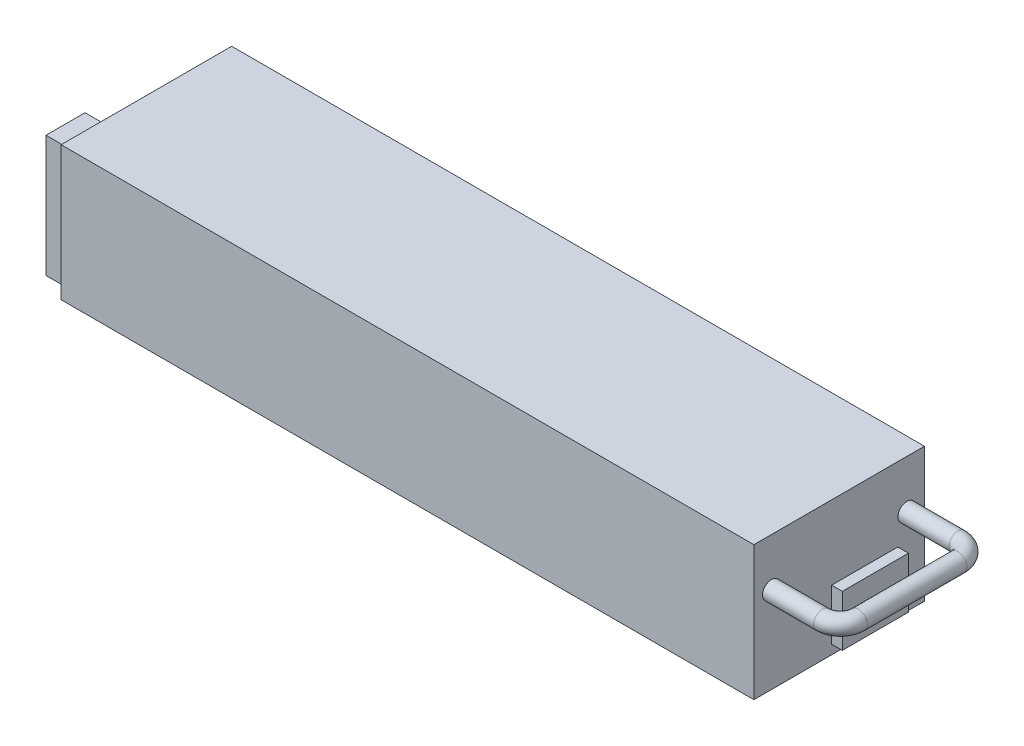
ISO-10303-21;
HEADER;
FILE_DESCRIPTION(('STEP AP214'),'2;1');
FILE_NAME('part.step','',(''),(''),'','','');
FILE_SCHEMA(('AUTOMOTIVE_DESIGN { 1 0 10303 214 1 1 1 1 }'));
ENDSEC;
DATA;
#1=APPLICATION_CONTEXT('core data for automotive mechanical design processes');
#2=APPLICATION_PROTOCOL_DEFINITION('international standard','automotive_design',2000,#1);
#3=PRODUCT_CONTEXT('',#1,'mechanical');
#4=PRODUCT('Part','Part','',(#3));
#5=PRODUCT_RELATED_PRODUCT_CATEGORY('part','',(#4));
#6=PRODUCT_DEFINITION_FORMATION('','',#4);
#7=PRODUCT_DEFINITION_CONTEXT('part definition',#1,'design');
#8=PRODUCT_DEFINITION('design','',#6,#7);
#9=PRODUCT_DEFINITION_SHAPE('','',#8);
#10=(LENGTH_UNIT() NAMED_UNIT(*) SI_UNIT(.MILLI.,.METRE.));
#11=(NAMED_UNIT(*) PLANE_ANGLE_UNIT() SI_UNIT($,.RADIAN.));
#12=(NAMED_UNIT(*) SI_UNIT($,.STERADIAN.) SOLID_ANGLE_UNIT());
#13=UNCERTAINTY_MEASURE_WITH_UNIT(LENGTH_MEASURE(1.E-05),#10,'distance_accuracy_value','');
#14=(GEOMETRIC_REPRESENTATION_CONTEXT(3) GLOBAL_UNCERTAINTY_ASSIGNED_CONTEXT((#13)) GLOBAL_UNIT_ASSIGNED_CONTEXT((#10,
#11,#12)) REPRESENTATION_CONTEXT('',''));
#15=CARTESIAN_POINT('',(0.,0.,0.));
#16=DIRECTION('',(0.,0.,1.));
#17=DIRECTION('',(1.,0.,0.));
#18=AXIS2_PLACEMENT_3D('',#15,#16,#17);
#19=CARTESIAN_POINT('',(-325.,63.,0.));
#20=DIRECTION('',(1.,0.,0.));
#21=DIRECTION('',(0.,0.,-1.));
#22=AXIS2_PLACEMENT_3D('',#19,#20,#21);
#23=PLANE('',#22);
#24=DIRECTION('',(0.,0.,1.));
#25=VECTOR('',#24,1.);
#26=CARTESIAN_POINT('',(-325.,0.,0.));
#27=LINE('',#26,#25);
#28=CARTESIAN_POINT('',(-325.,0.,0.));
#29=VERTEX_POINT('',#28);
#30=CARTESIAN_POINT('',(-325.,0.,80.));
#31=VERTEX_POINT('',#30);
#32=EDGE_CURVE('E210',#29,#31,#27,.T.);
#33=ORIENTED_EDGE('',*,*,#32,.T.);
#34=DIRECTION('',(0.,-1.,0.));
#35=VECTOR('',#34,1.);
#36=CARTESIAN_POINT('',(-325.,63.,80.));
#37=LINE('',#36,#35);
#38=CARTESIAN_POINT('',(-325.,63.,80.));
#39=VERTEX_POINT('',#38);
#40=EDGE_CURVE('E215',#39,#31,#37,.T.);
#41=ORIENTED_EDGE('',*,*,#40,.F.);
#42=DIRECTION('',(0.,0.,1.));
#43=VECTOR('',#42,1.);
#44=CARTESIAN_POINT('',(-325.,63.,0.));
#45=LINE('',#44,#43);
#46=CARTESIAN_POINT('',(-325.,63.,0.));
#47=VERTEX_POINT('',#46);
#48=EDGE_CURVE('E201',#47,#39,#45,.T.);
#49=ORIENTED_EDGE('',*,*,#48,.F.);
#50=DIRECTION('',(0.,-1.,0.));
#51=VECTOR('',#50,1.);
#52=CARTESIAN_POINT('',(-325.,63.,0.));
#53=LINE('',#52,#51);
#54=EDGE_CURVE('E218',#47,#29,#53,.T.);
#55=ORIENTED_EDGE('',*,*,#54,.T.);
#56=EDGE_LOOP('',(#33,#41,#49,#55));
#57=FACE_BOUND('',#56,.T.);
#58=DIRECTION('',(0.,-1.,0.));
#59=VECTOR('',#58,1.);
#60=CARTESIAN_POINT('',(-325.,59.8,58.178963042607));
#61=LINE('',#60,#59);
#62=CARTESIAN_POINT('',(-325.,59.8,58.178963042607));
#63=VERTEX_POINT('',#62);
#64=CARTESIAN_POINT('',(-325.,2.8,58.178963042607));
#65=VERTEX_POINT('',#64);
#66=EDGE_CURVE('E143',#63,#65,#61,.T.);
#67=ORIENTED_EDGE('',*,*,#66,.F.);
#68=DIRECTION('',(0.,0.,-1.));
#69=VECTOR('',#68,1.);
#70=CARTESIAN_POINT('',(-325.,59.8,58.178963042607));
#71=LINE('',#70,#69);
#72=CARTESIAN_POINT('',(-325.,59.8,76.5));
#73=VERTEX_POINT('',#72);
#74=EDGE_CURVE('E140',#73,#63,#71,.T.);
#75=ORIENTED_EDGE('',*,*,#74,.F.);
#76=DIRECTION('',(0.,1.,0.));
#77=VECTOR('',#76,1.);
#78=CARTESIAN_POINT('',(-325.,59.8,76.5));
#79=LINE('',#78,#77);
#80=CARTESIAN_POINT('',(-325.,2.8,76.5));
#81=VERTEX_POINT('',#80);
#82=EDGE_CURVE('E54',#81,#73,#79,.T.);
#83=ORIENTED_EDGE('',*,*,#82,.F.);
#84=DIRECTION('',(0.,0.,1.));
#85=VECTOR('',#84,1.);
#86=CARTESIAN_POINT('',(-325.,2.8,58.178963042607));
#87=LINE('',#86,#85);
#88=EDGE_CURVE('E49',#65,#81,#87,.T.);
#89=ORIENTED_EDGE('',*,*,#88,.F.);
#90=EDGE_LOOP('',(#67,#75,#83,#89));
#91=FACE_BOUND('',#90,.T.);
#92=ADVANCED_FACE('F34',(#57,#91),#23,.F.);
#93=CARTESIAN_POINT('',(0.,63.,0.));
#94=DIRECTION('',(-1.,0.,0.));
#95=DIRECTION('',(0.,0.,1.));
#96=AXIS2_PLACEMENT_3D('',#93,#94,#95);
#97=PLANE('',#96);
#98=DIRECTION('',(0.,0.,-1.));
#99=VECTOR('',#98,1.);
#100=CARTESIAN_POINT('',(0.,0.,0.));
#101=LINE('',#100,#99);
#102=CARTESIAN_POINT('',(0.,0.,80.));
#103=VERTEX_POINT('',#102);
#104=CARTESIAN_POINT('',(0.,0.,0.));
#105=VERTEX_POINT('',#104);
#106=EDGE_CURVE('E194',#103,#105,#101,.T.);
#107=ORIENTED_EDGE('',*,*,#106,.T.);
#108=DIRECTION('',(0.,-1.,0.));
#109=VECTOR('',#108,1.);
#110=CARTESIAN_POINT('',(0.,63.,0.));
#111=LINE('',#110,#109);
#112=CARTESIAN_POINT('',(0.,63.,0.));
#113=VERTEX_POINT('',#112);
#114=EDGE_CURVE('E221',#113,#105,#111,.T.);
#115=ORIENTED_EDGE('',*,*,#114,.F.);
#116=DIRECTION('',(0.,0.,-1.));
#117=VECTOR('',#116,1.);
#118=CARTESIAN_POINT('',(0.,63.,0.));
#119=LINE('',#118,#117);
#120=CARTESIAN_POINT('',(0.,63.,80.));
#121=VERTEX_POINT('',#120);
#122=EDGE_CURVE('E195',#121,#113,#119,.T.);
#123=ORIENTED_EDGE('',*,*,#122,.F.);
#124=DIRECTION('',(0.,-1.,0.));
#125=VECTOR('',#124,1.);
#126=CARTESIAN_POINT('',(0.,63.,80.));
#127=LINE('',#126,#125);
#128=EDGE_CURVE('E205',#121,#103,#127,.T.);
#129=ORIENTED_EDGE('',*,*,#128,.T.);
#130=EDGE_LOOP('',(#107,#115,#123,#129));
#131=FACE_BOUND('',#130,.T.);
#132=CARTESIAN_POINT('',(0.,40.5,71.75));
#133=DIRECTION('',(-1.,0.,0.));
#134=DIRECTION('',(0.,0.,1.));
#135=AXIS2_PLACEMENT_3D('',#132,#133,#134);
#136=CIRCLE('',#135,4.2);
#137=CARTESIAN_POINT('',(0.,40.5,75.95));
#138=VERTEX_POINT('',#137);
#139=EDGE_CURVE('E42',#138,#138,#136,.F.);
#140=ORIENTED_EDGE('',*,*,#139,.F.);
#141=EDGE_LOOP('',(#140));
#142=FACE_BOUND('',#141,.T.);
#143=CARTESIAN_POINT('',(0.,40.5,8.24999999999999));
#144=DIRECTION('',(-1.,0.,0.));
#145=DIRECTION('',(0.,0.,1.));
#146=AXIS2_PLACEMENT_3D('',#143,#144,#145);
#147=CIRCLE('',#146,4.2);
#148=CARTESIAN_POINT('',(0.,40.5,12.45));
#149=VERTEX_POINT('',#148);
#150=EDGE_CURVE('E11',#149,#149,#147,.F.);
#151=ORIENTED_EDGE('',*,*,#150,.F.);
#152=EDGE_LOOP('',(#151));
#153=FACE_BOUND('',#152,.T.);
#154=DIRECTION('',(0.,-1.,0.));
#155=VECTOR('',#154,1.);
#156=CARTESIAN_POINT('',(0.,4.3,43.5));
#157=LINE('',#156,#155);
#158=CARTESIAN_POINT('',(0.,28.3,43.5));
#159=VERTEX_POINT('',#158);
#160=CARTESIAN_POINT('',(0.,4.3,43.5));
#161=VERTEX_POINT('',#160);
#162=EDGE_CURVE('E144',#159,#161,#157,.T.);
#163=ORIENTED_EDGE('',*,*,#162,.F.);
#164=DIRECTION('',(0.,0.,1.));
#165=VECTOR('',#164,1.);
#166=CARTESIAN_POINT('',(0.,28.3,43.5));
#167=LINE('',#166,#165);
#168=CARTESIAN_POINT('',(0.,28.3,12.5));
#169=VERTEX_POINT('',#168);
#170=EDGE_CURVE('E157',#169,#159,#167,.T.);
#171=ORIENTED_EDGE('',*,*,#170,.F.);
#172=DIRECTION('',(0.,1.,0.));
#173=VECTOR('',#172,1.);
#174=CARTESIAN_POINT('',(0.,4.3,12.5));
#175=LINE('',#174,#173);
#176=CARTESIAN_POINT('',(0.,4.3,12.5));
#177=VERTEX_POINT('',#176);
#178=EDGE_CURVE('E166',#177,#169,#175,.T.);
#179=ORIENTED_EDGE('',*,*,#178,.F.);
#180=DIRECTION('',(0.,0.,-1.));
#181=VECTOR('',#180,1.);
#182=CARTESIAN_POINT('',(0.,4.3,43.5));
#183=LINE('',#182,#181);
#184=EDGE_CURVE('E147',#161,#177,#183,.T.);
#185=ORIENTED_EDGE('',*,*,#184,.F.);
#186=EDGE_LOOP('',(#163,#171,#179,#185));
#187=FACE_BOUND('',#186,.T.);
#188=ADVANCED_FACE('F36',(#131,#142,#153,#187),#97,.F.);
#189=CARTESIAN_POINT('',(0.,63.,0.));
#190=DIRECTION('',(0.,0.,1.));
#191=DIRECTION('',(1.,0.,0.));
#192=AXIS2_PLACEMENT_3D('',#189,#190,#191);
#193=PLANE('',#192);
#194=CARTESIAN_POINT('',(-5.25,26.,0.));
#195=DIRECTION('',(0.,0.,-1.));
#196=DIRECTION('',(-1.,0.,0.));
#197=AXIS2_PLACEMENT_3D('',#194,#195,#196);
#198=CIRCLE('',#197,1.5);
#199=CARTESIAN_POINT('',(-6.75,26.,0.));
#200=VERTEX_POINT('',#199);
#201=EDGE_CURVE('E278',#200,#200,#198,.T.);
#202=ORIENTED_EDGE('',*,*,#201,.F.);
#203=EDGE_LOOP('',(#202));
#204=FACE_BOUND('',#203,.T.);
#205=CARTESIAN_POINT('',(-297.,58.,0.));
#206=DIRECTION('',(0.,0.,-1.));
#207=DIRECTION('',(-1.,0.,0.));
#208=AXIS2_PLACEMENT_3D('',#205,#206,#207);
#209=CIRCLE('',#208,1.50000000000002);
#210=CARTESIAN_POINT('',(-298.5,58.,0.));
#211=VERTEX_POINT('',#210);
#212=EDGE_CURVE('E282',#211,#211,#209,.T.);
#213=ORIENTED_EDGE('',*,*,#212,.F.);
#214=EDGE_LOOP('',(#213));
#215=FACE_BOUND('',#214,.T.);
#216=DIRECTION('',(-1.,0.,0.));
#217=VECTOR('',#216,1.);
#218=CARTESIAN_POINT('',(0.,0.,0.));
#219=LINE('',#218,#217);
#220=EDGE_CURVE('E208',#105,#29,#219,.T.);
#221=ORIENTED_EDGE('',*,*,#220,.T.);
#222=ORIENTED_EDGE('',*,*,#54,.F.);
#223=DIRECTION('',(-1.,0.,0.));
#224=VECTOR('',#223,1.);
#225=CARTESIAN_POINT('',(0.,63.,0.));
#226=LINE('',#225,#224);
#227=EDGE_CURVE('E198',#113,#47,#226,.T.);
#228=ORIENTED_EDGE('',*,*,#227,.F.);
#229=ORIENTED_EDGE('',*,*,#114,.T.);
#230=EDGE_LOOP('',(#221,#222,#228,#229));
#231=FACE_BOUND('',#230,.T.);
#232=ADVANCED_FACE('F230',(#204,#215,#231),#193,.F.);
#233=CARTESIAN_POINT('',(0.,63.,80.));
#234=DIRECTION('',(0.,0.,-1.));
#235=DIRECTION('',(-1.,0.,0.));
#236=AXIS2_PLACEMENT_3D('',#233,#234,#235);
#237=PLANE('',#236);
#238=DIRECTION('',(1.,0.,0.));
#239=VECTOR('',#238,1.);
#240=CARTESIAN_POINT('',(0.,0.,80.));
#241=LINE('',#240,#239);
#242=EDGE_CURVE('E199',#31,#103,#241,.T.);
#243=ORIENTED_EDGE('',*,*,#242,.T.);
#244=ORIENTED_EDGE('',*,*,#128,.F.);
#245=DIRECTION('',(1.,0.,0.));
#246=VECTOR('',#245,1.);
#247=CARTESIAN_POINT('',(0.,63.,80.));
#248=LINE('',#247,#246);
#249=EDGE_CURVE('E203',#39,#121,#248,.T.);
#250=ORIENTED_EDGE('',*,*,#249,.F.);
#251=ORIENTED_EDGE('',*,*,#40,.T.);
#252=EDGE_LOOP('',(#243,#244,#250,#251));
#253=FACE_BOUND('',#252,.T.);
#254=ADVANCED_FACE('F266',(#253),#237,.F.);
#255=CARTESIAN_POINT('',(0.,63.,0.));
#256=DIRECTION('',(0.,-1.,0.));
#257=DIRECTION('',(0.,0.,-1.));
#258=AXIS2_PLACEMENT_3D('',#255,#256,#257);
#259=PLANE('',#258);
#260=ORIENTED_EDGE('',*,*,#122,.T.);
#261=ORIENTED_EDGE('',*,*,#227,.T.);
#262=ORIENTED_EDGE('',*,*,#48,.T.);
#263=ORIENTED_EDGE('',*,*,#249,.T.);
#264=EDGE_LOOP('',(#260,#261,#262,#263));
#265=FACE_BOUND('',#264,.T.);
#266=ADVANCED_FACE('F273',(#265),#259,.F.);
#267=CARTESIAN_POINT('',(0.,0.,0.));
#268=DIRECTION('',(0.,-1.,0.));
#269=DIRECTION('',(0.,0.,-1.));
#270=AXIS2_PLACEMENT_3D('',#267,#268,#269);
#271=PLANE('',#270);
#272=CARTESIAN_POINT('',(-317.,0.,65.));
#273=DIRECTION('',(0.,-1.,0.));
#274=DIRECTION('',(0.,0.,-1.));
#275=AXIS2_PLACEMENT_3D('',#272,#273,#274);
#276=CIRCLE('',#275,1.50000000000002);
#277=CARTESIAN_POINT('',(-317.,0.,63.5));
#278=VERTEX_POINT('',#277);
#279=EDGE_CURVE('E547',#278,#278,#276,.T.);
#280=ORIENTED_EDGE('',*,*,#279,.F.);
#281=EDGE_LOOP('',(#280));
#282=FACE_BOUND('',#281,.T.);
#283=CARTESIAN_POINT('',(-162.5,0.,74.5));
#284=DIRECTION('',(0.,-1.,0.));
#285=DIRECTION('',(0.,0.,-1.));
#286=AXIS2_PLACEMENT_3D('',#283,#284,#285);
#287=CIRCLE('',#286,1.5);
#288=CARTESIAN_POINT('',(-162.5,0.,73.));
#289=VERTEX_POINT('',#288);
#290=EDGE_CURVE('E553',#289,#289,#287,.T.);
#291=ORIENTED_EDGE('',*,*,#290,.F.);
#292=EDGE_LOOP('',(#291));
#293=FACE_BOUND('',#292,.T.);
#294=CARTESIAN_POINT('',(-5.24999999999998,0.,55.));
#295=DIRECTION('',(0.,-1.,0.));
#296=DIRECTION('',(0.,0.,-1.));
#297=AXIS2_PLACEMENT_3D('',#294,#295,#296);
#298=CIRCLE('',#297,1.5);
#299=CARTESIAN_POINT('',(-5.24999999999998,0.,53.5));
#300=VERTEX_POINT('',#299);
#301=EDGE_CURVE('E533',#300,#300,#298,.T.);
#302=ORIENTED_EDGE('',*,*,#301,.F.);
#303=EDGE_LOOP('',(#302));
#304=FACE_BOUND('',#303,.T.);
#305=ORIENTED_EDGE('',*,*,#106,.F.);
#306=ORIENTED_EDGE('',*,*,#242,.F.);
#307=ORIENTED_EDGE('',*,*,#32,.F.);
#308=ORIENTED_EDGE('',*,*,#220,.F.);
#309=EDGE_LOOP('',(#305,#306,#307,#308));
#310=FACE_BOUND('',#309,.T.);
#311=ADVANCED_FACE('F291',(#282,#293,#304,#310),#271,.T.);
#312=CARTESIAN_POINT('',(24.,40.5,71.75));
#313=DIRECTION('',(-1.,0.,0.));
#314=DIRECTION('',(0.,0.,1.));
#315=AXIS2_PLACEMENT_3D('',#312,#313,#314);
#316=CYLINDRICAL_SURFACE('',#315,4.2);
#317=CARTESIAN_POINT('',(24.,40.5,71.75));
#318=DIRECTION('',(1.,0.,0.));
#319=DIRECTION('',(0.,0.,-1.));
#320=AXIS2_PLACEMENT_3D('',#317,#318,#319);
#321=CIRCLE('',#320,4.2);
#322=CARTESIAN_POINT('',(24.,40.5,75.95));
#323=VERTEX_POINT('',#322);
#324=EDGE_CURVE('E191',#323,#323,#321,.T.);
#325=ORIENTED_EDGE('',*,*,#324,.F.);
#326=EDGE_LOOP('',(#325));
#327=FACE_BOUND('',#326,.T.);
#328=ORIENTED_EDGE('',*,*,#139,.T.);
#329=EDGE_LOOP('',(#328));
#330=FACE_BOUND('',#329,.T.);
#331=ADVANCED_FACE('F226',(#327,#330),#316,.T.);
#332=CARTESIAN_POINT('',(24.,40.5,8.24999999999999));
#333=DIRECTION('',(-1.,0.,0.));
#334=DIRECTION('',(0.,0.,1.));
#335=AXIS2_PLACEMENT_3D('',#332,#333,#334);
#336=CYLINDRICAL_SURFACE('',#335,4.2);
#337=CARTESIAN_POINT('',(24.,40.5,8.24999999999999));
#338=DIRECTION('',(1.,0.,0.));
#339=DIRECTION('',(0.,0.,-1.));
#340=AXIS2_PLACEMENT_3D('',#337,#338,#339);
#341=CIRCLE('',#340,4.2);
#342=CARTESIAN_POINT('',(24.,40.5,4.04999999999999));
#343=VERTEX_POINT('',#342);
#344=EDGE_CURVE('E188',#343,#343,#341,.T.);
#345=ORIENTED_EDGE('',*,*,#344,.F.);
#346=EDGE_LOOP('',(#345));
#347=FACE_BOUND('',#346,.T.);
#348=ORIENTED_EDGE('',*,*,#150,.T.);
#349=EDGE_LOOP('',(#348));
#350=FACE_BOUND('',#349,.T.);
#351=ADVANCED_FACE('F305',(#347,#350),#336,.T.);
#352=CARTESIAN_POINT('',(24.,40.5,63.35));
#353=DIRECTION('',(0.,-1.,0.));
#354=DIRECTION('',(0.,0.,-1.));
#355=AXIS2_PLACEMENT_3D('',#352,#353,#354);
#356=TOROIDAL_SURFACE('',#355,8.40000000000001,4.2);
#357=CARTESIAN_POINT('',(32.4,40.5,63.35));
#358=DIRECTION('',(0.,0.,-1.));
#359=DIRECTION('',(-1.,0.,0.));
#360=AXIS2_PLACEMENT_3D('',#357,#358,#359);
#361=CIRCLE('',#360,4.2);
#362=CARTESIAN_POINT('',(36.6,40.5,63.35));
#363=VERTEX_POINT('',#362);
#364=EDGE_CURVE('E185',#363,#363,#361,.T.);
#365=CARTESIAN_POINT('',(24.,40.5,63.35));
#366=DIRECTION('',(0.,-1.,0.));
#367=DIRECTION('',(0.,0.,-1.));
#368=AXIS2_PLACEMENT_3D('',#365,#366,#367);
#369=CIRCLE('',#368,12.6);
#370=EDGE_CURVE('',#363,#323,#369,.T.);
#371=ORIENTED_EDGE('',*,*,#364,.F.);
#372=ORIENTED_EDGE('',*,*,#324,.T.);
#373=ORIENTED_EDGE('',*,*,#370,.T.);
#374=ORIENTED_EDGE('',*,*,#370,.F.);
#375=EDGE_LOOP('',(#371,#373,#372,#374));
#376=FACE_BOUND('',#375,.T.);
#377=ADVANCED_FACE('F309',(#376),#356,.T.);
#378=CARTESIAN_POINT('',(24.,40.5,16.65));
#379=DIRECTION('',(0.,1.,0.));
#380=DIRECTION('',(0.,0.,1.));
#381=AXIS2_PLACEMENT_3D('',#378,#379,#380);
#382=TOROIDAL_SURFACE('',#381,8.4,4.2);
#383=CARTESIAN_POINT('',(32.4,40.5,16.65));
#384=DIRECTION('',(0.,0.,1.));
#385=DIRECTION('',(1.,0.,0.));
#386=AXIS2_PLACEMENT_3D('',#383,#384,#385);
#387=CIRCLE('',#386,4.2);
#388=CARTESIAN_POINT('',(36.6,40.5,16.65));
#389=VERTEX_POINT('',#388);
#390=EDGE_CURVE('E182',#389,#389,#387,.T.);
#391=CARTESIAN_POINT('',(24.,40.5,16.65));
#392=DIRECTION('',(0.,1.,0.));
#393=DIRECTION('',(0.,0.,1.));
#394=AXIS2_PLACEMENT_3D('',#391,#392,#393);
#395=CIRCLE('',#394,12.6);
#396=EDGE_CURVE('',#389,#343,#395,.T.);
#397=ORIENTED_EDGE('',*,*,#390,.F.);
#398=ORIENTED_EDGE('',*,*,#344,.T.);
#399=ORIENTED_EDGE('',*,*,#396,.T.);
#400=ORIENTED_EDGE('',*,*,#396,.F.);
#401=EDGE_LOOP('',(#397,#399,#398,#400));
#402=FACE_BOUND('',#401,.T.);
#403=ADVANCED_FACE('F313',(#402),#382,.T.);
#404=CARTESIAN_POINT('',(32.4,40.5,75.229393923934));
#405=DIRECTION('',(0.,0.,-1.));
#406=DIRECTION('',(-1.,0.,0.));
#407=AXIS2_PLACEMENT_3D('',#404,#405,#406);
#408=CYLINDRICAL_SURFACE('',#407,4.2);
#409=ORIENTED_EDGE('',*,*,#364,.T.);
#410=EDGE_LOOP('',(#409));
#411=FACE_BOUND('',#410,.T.);
#412=ORIENTED_EDGE('',*,*,#390,.T.);
#413=EDGE_LOOP('',(#412));
#414=FACE_BOUND('',#413,.T.);
#415=ADVANCED_FACE('F258',(#411,#414),#408,.T.);
#416=CARTESIAN_POINT('',(5.,4.3,43.5));
#417=DIRECTION('',(0.,0.,-1.));
#418=DIRECTION('',(-1.,0.,0.));
#419=AXIS2_PLACEMENT_3D('',#416,#417,#418);
#420=PLANE('',#419);
#421=ORIENTED_EDGE('',*,*,#162,.T.);
#422=DIRECTION('',(-1.,0.,0.));
#423=VECTOR('',#422,1.);
#424=CARTESIAN_POINT('',(5.,4.3,43.5));
#425=LINE('',#424,#423);
#426=CARTESIAN_POINT('',(5.,4.3,43.5));
#427=VERTEX_POINT('',#426);
#428=EDGE_CURVE('E179',#427,#161,#425,.T.);
#429=ORIENTED_EDGE('',*,*,#428,.F.);
#430=DIRECTION('',(0.,-1.,0.));
#431=VECTOR('',#430,1.);
#432=CARTESIAN_POINT('',(5.,4.3,43.5));
#433=LINE('',#432,#431);
#434=CARTESIAN_POINT('',(5.,28.3,43.5));
#435=VERTEX_POINT('',#434);
#436=EDGE_CURVE('E153',#435,#427,#433,.T.);
#437=ORIENTED_EDGE('',*,*,#436,.F.);
#438=DIRECTION('',(-1.,0.,0.));
#439=VECTOR('',#438,1.);
#440=CARTESIAN_POINT('',(5.,28.3,43.5));
#441=LINE('',#440,#439);
#442=EDGE_CURVE('E162',#435,#159,#441,.T.);
#443=ORIENTED_EDGE('',*,*,#442,.T.);
#444=EDGE_LOOP('',(#421,#429,#437,#443));
#445=FACE_BOUND('',#444,.T.);
#446=ADVANCED_FACE('F242',(#445),#420,.F.);
#447=CARTESIAN_POINT('',(5.,4.3,43.5));
#448=DIRECTION('',(0.,1.,0.));
#449=DIRECTION('',(0.,0.,1.));
#450=AXIS2_PLACEMENT_3D('',#447,#448,#449);
#451=PLANE('',#450);
#452=ORIENTED_EDGE('',*,*,#184,.T.);
#453=DIRECTION('',(-1.,0.,0.));
#454=VECTOR('',#453,1.);
#455=CARTESIAN_POINT('',(5.,4.3,12.5));
#456=LINE('',#455,#454);
#457=CARTESIAN_POINT('',(5.,4.3,12.5));
#458=VERTEX_POINT('',#457);
#459=EDGE_CURVE('E176',#458,#177,#456,.T.);
#460=ORIENTED_EDGE('',*,*,#459,.F.);
#461=DIRECTION('',(0.,0.,-1.));
#462=VECTOR('',#461,1.);
#463=CARTESIAN_POINT('',(5.,4.3,43.5));
#464=LINE('',#463,#462);
#465=EDGE_CURVE('E156',#427,#458,#464,.T.);
#466=ORIENTED_EDGE('',*,*,#465,.F.);
#467=ORIENTED_EDGE('',*,*,#428,.T.);
#468=EDGE_LOOP('',(#452,#460,#466,#467));
#469=FACE_BOUND('',#468,.T.);
#470=ADVANCED_FACE('F250',(#469),#451,.F.);
#471=CARTESIAN_POINT('',(5.,4.3,12.5));
#472=DIRECTION('',(0.,0.,1.));
#473=DIRECTION('',(1.,0.,0.));
#474=AXIS2_PLACEMENT_3D('',#471,#472,#473);
#475=PLANE('',#474);
#476=ORIENTED_EDGE('',*,*,#178,.T.);
#477=DIRECTION('',(-1.,0.,0.));
#478=VECTOR('',#477,1.);
#479=CARTESIAN_POINT('',(5.,28.3,12.5));
#480=LINE('',#479,#478);
#481=CARTESIAN_POINT('',(5.,28.3,12.5));
#482=VERTEX_POINT('',#481);
#483=EDGE_CURVE('E173',#482,#169,#480,.T.);
#484=ORIENTED_EDGE('',*,*,#483,.F.);
#485=DIRECTION('',(0.,1.,0.));
#486=VECTOR('',#485,1.);
#487=CARTESIAN_POINT('',(5.,4.3,12.5));
#488=LINE('',#487,#486);
#489=EDGE_CURVE('E159',#458,#482,#488,.T.);
#490=ORIENTED_EDGE('',*,*,#489,.F.);
#491=ORIENTED_EDGE('',*,*,#459,.T.);
#492=EDGE_LOOP('',(#476,#484,#490,#491));
#493=FACE_BOUND('',#492,.T.);
#494=ADVANCED_FACE('F248',(#493),#475,.F.);
#495=CARTESIAN_POINT('',(5.,28.3,43.5));
#496=DIRECTION('',(0.,-1.,0.));
#497=DIRECTION('',(0.,0.,-1.));
#498=AXIS2_PLACEMENT_3D('',#495,#496,#497);
#499=PLANE('',#498);
#500=ORIENTED_EDGE('',*,*,#170,.T.);
#501=ORIENTED_EDGE('',*,*,#442,.F.);
#502=DIRECTION('',(0.,0.,1.));
#503=VECTOR('',#502,1.);
#504=CARTESIAN_POINT('',(5.,28.3,43.5));
#505=LINE('',#504,#503);
#506=EDGE_CURVE('E161',#482,#435,#505,.T.);
#507=ORIENTED_EDGE('',*,*,#506,.F.);
#508=ORIENTED_EDGE('',*,*,#483,.T.);
#509=EDGE_LOOP('',(#500,#501,#507,#508));
#510=FACE_BOUND('',#509,.T.);
#511=ADVANCED_FACE('F238',(#510),#499,.F.);
#512=CARTESIAN_POINT('',(5.,0.,0.));
#513=DIRECTION('',(-1.,0.,0.));
#514=DIRECTION('',(0.,0.,1.));
#515=AXIS2_PLACEMENT_3D('',#512,#513,#514);
#516=PLANE('',#515);
#517=ORIENTED_EDGE('',*,*,#436,.T.);
#518=ORIENTED_EDGE('',*,*,#465,.T.);
#519=ORIENTED_EDGE('',*,*,#489,.T.);
#520=ORIENTED_EDGE('',*,*,#506,.T.);
#521=EDGE_LOOP('',(#517,#518,#519,#520));
#522=FACE_BOUND('',#521,.T.);
#523=ADVANCED_FACE('F244',(#522),#516,.F.);
#524=CARTESIAN_POINT('',(-335.6,59.8,58.178963042607));
#525=DIRECTION('',(0.,0.,1.));
#526=DIRECTION('',(0.,-1.,0.));
#527=AXIS2_PLACEMENT_3D('',#524,#525,#526);
#528=PLANE('',#527);
#529=ORIENTED_EDGE('',*,*,#66,.T.);
#530=DIRECTION('',(1.,0.,0.));
#531=VECTOR('',#530,1.);
#532=CARTESIAN_POINT('',(-335.6,2.8,58.178963042607));
#533=LINE('',#532,#531);
#534=CARTESIAN_POINT('',(-335.6,2.8,58.178963042607));
#535=VERTEX_POINT('',#534);
#536=EDGE_CURVE('E124',#535,#65,#533,.T.);
#537=ORIENTED_EDGE('',*,*,#536,.F.);
#538=DIRECTION('',(0.,-1.,0.));
#539=VECTOR('',#538,1.);
#540=CARTESIAN_POINT('',(-335.6,59.8,58.178963042607));
#541=LINE('',#540,#539);
#542=CARTESIAN_POINT('',(-335.6,59.8,58.178963042607));
#543=VERTEX_POINT('',#542);
#544=EDGE_CURVE('E131',#543,#535,#541,.T.);
#545=ORIENTED_EDGE('',*,*,#544,.F.);
#546=DIRECTION('',(1.,0.,0.));
#547=VECTOR('',#546,1.);
#548=CARTESIAN_POINT('',(-335.6,59.8,58.178963042607));
#549=LINE('',#548,#547);
#550=EDGE_CURVE('E560',#543,#63,#549,.T.);
#551=ORIENTED_EDGE('',*,*,#550,.T.);
#552=EDGE_LOOP('',(#529,#537,#545,#551));
#553=FACE_BOUND('',#552,.T.);
#554=ADVANCED_FACE('F142',(#553),#528,.F.);
#555=CARTESIAN_POINT('',(-335.6,2.8,58.178963042607));
#556=DIRECTION('',(0.,1.,0.));
#557=DIRECTION('',(0.,0.,1.));
#558=AXIS2_PLACEMENT_3D('',#555,#556,#557);
#559=PLANE('',#558);
#560=ORIENTED_EDGE('',*,*,#88,.T.);
#561=DIRECTION('',(1.,0.,0.));
#562=VECTOR('',#561,1.);
#563=CARTESIAN_POINT('',(-335.6,2.8,76.5));
#564=LINE('',#563,#562);
#565=CARTESIAN_POINT('',(-335.6,2.8,76.5));
#566=VERTEX_POINT('',#565);
#567=EDGE_CURVE('E127',#566,#81,#564,.T.);
#568=ORIENTED_EDGE('',*,*,#567,.F.);
#569=DIRECTION('',(0.,0.,1.));
#570=VECTOR('',#569,1.);
#571=CARTESIAN_POINT('',(-335.6,2.8,58.178963042607));
#572=LINE('',#571,#570);
#573=EDGE_CURVE('E120',#535,#566,#572,.T.);
#574=ORIENTED_EDGE('',*,*,#573,.F.);
#575=ORIENTED_EDGE('',*,*,#536,.T.);
#576=EDGE_LOOP('',(#560,#568,#574,#575));
#577=FACE_BOUND('',#576,.T.);
#578=ADVANCED_FACE('F122',(#577),#559,.F.);
#579=CARTESIAN_POINT('',(-335.6,59.8,76.5));
#580=DIRECTION('',(0.,0.,-1.));
#581=DIRECTION('',(-1.,0.,0.));
#582=AXIS2_PLACEMENT_3D('',#579,#580,#581);
#583=PLANE('',#582);
#584=ORIENTED_EDGE('',*,*,#82,.T.);
#585=DIRECTION('',(1.,0.,0.));
#586=VECTOR('',#585,1.);
#587=CARTESIAN_POINT('',(-335.6,59.8,76.5));
#588=LINE('',#587,#586);
#589=CARTESIAN_POINT('',(-335.6,59.8,76.5));
#590=VERTEX_POINT('',#589);
#591=EDGE_CURVE('E149',#590,#73,#588,.T.);
#592=ORIENTED_EDGE('',*,*,#591,.F.);
#593=DIRECTION('',(0.,1.,0.));
#594=VECTOR('',#593,1.);
#595=CARTESIAN_POINT('',(-335.6,59.8,76.5));
#596=LINE('',#595,#594);
#597=EDGE_CURVE('E130',#566,#590,#596,.T.);
#598=ORIENTED_EDGE('',*,*,#597,.F.);
#599=ORIENTED_EDGE('',*,*,#567,.T.);
#600=EDGE_LOOP('',(#584,#592,#598,#599));
#601=FACE_BOUND('',#600,.T.);
#602=ADVANCED_FACE('F386',(#601),#583,.F.);
#603=CARTESIAN_POINT('',(-335.6,59.8,58.178963042607));
#604=DIRECTION('',(0.,-1.,0.));
#605=DIRECTION('',(0.,0.,-1.));
#606=AXIS2_PLACEMENT_3D('',#603,#604,#605);
#607=PLANE('',#606);
#608=ORIENTED_EDGE('',*,*,#74,.T.);
#609=ORIENTED_EDGE('',*,*,#550,.F.);
#610=DIRECTION('',(0.,0.,-1.));
#611=VECTOR('',#610,1.);
#612=CARTESIAN_POINT('',(-335.6,59.8,58.178963042607));
#613=LINE('',#612,#611);
#614=EDGE_CURVE('E136',#590,#543,#613,.T.);
#615=ORIENTED_EDGE('',*,*,#614,.F.);
#616=ORIENTED_EDGE('',*,*,#591,.T.);
#617=EDGE_LOOP('',(#608,#609,#615,#616));
#618=FACE_BOUND('',#617,.T.);
#619=ADVANCED_FACE('F395',(#618),#607,.F.);
#620=CARTESIAN_POINT('',(-335.6,0.,0.));
#621=DIRECTION('',(-1.,0.,0.));
#622=DIRECTION('',(0.,0.,1.));
#623=AXIS2_PLACEMENT_3D('',#620,#621,#622);
#624=PLANE('',#623);
#625=ORIENTED_EDGE('',*,*,#544,.T.);
#626=ORIENTED_EDGE('',*,*,#573,.T.);
#627=ORIENTED_EDGE('',*,*,#597,.T.);
#628=ORIENTED_EDGE('',*,*,#614,.T.);
#629=EDGE_LOOP('',(#625,#626,#627,#628));
#630=FACE_BOUND('',#629,.T.);
#631=ADVANCED_FACE('F134',(#630),#624,.T.);
#632=CARTESIAN_POINT('',(-5.24999999999998,12.,55.));
#633=DIRECTION('',(0.,-1.,0.));
#634=DIRECTION('',(0.,0.,-1.));
#635=AXIS2_PLACEMENT_3D('',#632,#633,#634);
#636=CYLINDRICAL_SURFACE('',#635,1.5);
#637=CARTESIAN_POINT('',(-5.24999999999998,12.,55.));
#638=DIRECTION('',(0.,-1.,0.));
#639=DIRECTION('',(0.,0.,-1.));
#640=AXIS2_PLACEMENT_3D('',#637,#638,#639);
#641=CIRCLE('',#640,1.5);
#642=CARTESIAN_POINT('',(-5.24999999999998,12.,53.5));
#643=VERTEX_POINT('',#642);
#644=EDGE_CURVE('E536',#643,#643,#641,.T.);
#645=ORIENTED_EDGE('',*,*,#644,.F.);
#646=EDGE_LOOP('',(#645));
#647=FACE_BOUND('',#646,.T.);
#648=ORIENTED_EDGE('',*,*,#301,.T.);
#649=EDGE_LOOP('',(#648));
#650=FACE_BOUND('',#649,.T.);
#651=ADVANCED_FACE('F414',(#647,#650),#636,.F.);
#652=CARTESIAN_POINT('',(-5.24999999999998,12.,55.));
#653=DIRECTION('',(0.,-1.,0.));
#654=DIRECTION('',(0.,0.,-1.));
#655=AXIS2_PLACEMENT_3D('',#652,#653,#654);
#656=PLANE('',#655);
#657=ORIENTED_EDGE('',*,*,#644,.T.);
#658=EDGE_LOOP('',(#657));
#659=FACE_BOUND('',#658,.T.);
#660=ADVANCED_FACE('F431',(#659),#656,.T.);
#661=CARTESIAN_POINT('',(-162.5,12.,74.5));
#662=DIRECTION('',(0.,-1.,0.));
#663=DIRECTION('',(0.,0.,-1.));
#664=AXIS2_PLACEMENT_3D('',#661,#662,#663);
#665=CYLINDRICAL_SURFACE('',#664,1.5);
#666=CARTESIAN_POINT('',(-162.5,12.,74.5));
#667=DIRECTION('',(0.,-1.,0.));
#668=DIRECTION('',(0.,0.,-1.));
#669=AXIS2_PLACEMENT_3D('',#666,#667,#668);
#670=CIRCLE('',#669,1.5);
#671=CARTESIAN_POINT('',(-162.5,12.,73.));
#672=VERTEX_POINT('',#671);
#673=EDGE_CURVE('E550',#672,#672,#670,.T.);
#674=ORIENTED_EDGE('',*,*,#673,.F.);
#675=EDGE_LOOP('',(#674));
#676=FACE_BOUND('',#675,.T.);
#677=ORIENTED_EDGE('',*,*,#290,.T.);
#678=EDGE_LOOP('',(#677));
#679=FACE_BOUND('',#678,.T.);
#680=ADVANCED_FACE('F441',(#676,#679),#665,.F.);
#681=CARTESIAN_POINT('',(-162.5,12.,74.5));
#682=DIRECTION('',(0.,-1.,0.));
#683=DIRECTION('',(0.,0.,-1.));
#684=AXIS2_PLACEMENT_3D('',#681,#682,#683);
#685=PLANE('',#684);
#686=ORIENTED_EDGE('',*,*,#673,.T.);
#687=EDGE_LOOP('',(#686));
#688=FACE_BOUND('',#687,.T.);
#689=ADVANCED_FACE('F451',(#688),#685,.T.);
#690=CARTESIAN_POINT('',(-317.,12.,65.));
#691=DIRECTION('',(0.,-1.,0.));
#692=DIRECTION('',(0.,0.,-1.));
#693=AXIS2_PLACEMENT_3D('',#690,#691,#692);
#694=CYLINDRICAL_SURFACE('',#693,1.50000000000002);
#695=CARTESIAN_POINT('',(-317.,12.,65.));
#696=DIRECTION('',(0.,-1.,0.));
#697=DIRECTION('',(0.,0.,-1.));
#698=AXIS2_PLACEMENT_3D('',#695,#696,#697);
#699=CIRCLE('',#698,1.50000000000002);
#700=CARTESIAN_POINT('',(-317.,12.,63.5));
#701=VERTEX_POINT('',#700);
#702=EDGE_CURVE('E544',#701,#701,#699,.T.);
#703=ORIENTED_EDGE('',*,*,#702,.F.);
#704=EDGE_LOOP('',(#703));
#705=FACE_BOUND('',#704,.T.);
#706=ORIENTED_EDGE('',*,*,#279,.T.);
#707=EDGE_LOOP('',(#706));
#708=FACE_BOUND('',#707,.T.);
#709=ADVANCED_FACE('F461',(#705,#708),#694,.F.);
#710=CARTESIAN_POINT('',(-317.,12.,65.));
#711=DIRECTION('',(0.,-1.,0.));
#712=DIRECTION('',(0.,0.,-1.));
#713=AXIS2_PLACEMENT_3D('',#710,#711,#712);
#714=PLANE('',#713);
#715=ORIENTED_EDGE('',*,*,#702,.T.);
#716=EDGE_LOOP('',(#715));
#717=FACE_BOUND('',#716,.T.);
#718=ADVANCED_FACE('F471',(#717),#714,.T.);
#719=CARTESIAN_POINT('',(-297.,58.,12.));
#720=DIRECTION('',(0.,0.,-1.));
#721=DIRECTION('',(-1.,0.,0.));
#722=AXIS2_PLACEMENT_3D('',#719,#720,#721);
#723=CYLINDRICAL_SURFACE('',#722,1.50000000000002);
#724=CARTESIAN_POINT('',(-297.,58.,12.));
#725=DIRECTION('',(0.,0.,-1.));
#726=DIRECTION('',(-1.,0.,0.));
#727=AXIS2_PLACEMENT_3D('',#724,#725,#726);
#728=CIRCLE('',#727,1.50000000000002);
#729=CARTESIAN_POINT('',(-298.5,58.,12.));
#730=VERTEX_POINT('',#729);
#731=EDGE_CURVE('E538',#730,#730,#728,.T.);
#732=ORIENTED_EDGE('',*,*,#731,.F.);
#733=EDGE_LOOP('',(#732));
#734=FACE_BOUND('',#733,.T.);
#735=ORIENTED_EDGE('',*,*,#212,.T.);
#736=EDGE_LOOP('',(#735));
#737=FACE_BOUND('',#736,.T.);
#738=ADVANCED_FACE('F480',(#734,#737),#723,.F.);
#739=CARTESIAN_POINT('',(-297.,58.,12.));
#740=DIRECTION('',(0.,0.,-1.));
#741=DIRECTION('',(-1.,0.,0.));
#742=AXIS2_PLACEMENT_3D('',#739,#740,#741);
#743=PLANE('',#742);
#744=ORIENTED_EDGE('',*,*,#731,.T.);
#745=EDGE_LOOP('',(#744));
#746=FACE_BOUND('',#745,.T.);
#747=ADVANCED_FACE('F496',(#746),#743,.T.);
#748=CARTESIAN_POINT('',(-5.25,26.,12.));
#749=DIRECTION('',(0.,0.,-1.));
#750=DIRECTION('',(-1.,0.,0.));
#751=AXIS2_PLACEMENT_3D('',#748,#749,#750);
#752=CYLINDRICAL_SURFACE('',#751,1.5);
#753=CARTESIAN_POINT('',(-5.25,26.,12.));
#754=DIRECTION('',(0.,0.,-1.));
#755=DIRECTION('',(-1.,0.,0.));
#756=AXIS2_PLACEMENT_3D('',#753,#754,#755);
#757=CIRCLE('',#756,1.5);
#758=CARTESIAN_POINT('',(-6.75,26.,12.));
#759=VERTEX_POINT('',#758);
#760=EDGE_CURVE('E532',#759,#759,#757,.T.);
#761=ORIENTED_EDGE('',*,*,#760,.F.);
#762=EDGE_LOOP('',(#761));
#763=FACE_BOUND('',#762,.T.);
#764=ORIENTED_EDGE('',*,*,#201,.T.);
#765=EDGE_LOOP('',(#764));
#766=FACE_BOUND('',#765,.T.);
#767=ADVANCED_FACE('F506',(#763,#766),#752,.F.);
#768=CARTESIAN_POINT('',(-5.25,26.,12.));
#769=DIRECTION('',(0.,0.,-1.));
#770=DIRECTION('',(-1.,0.,0.));
#771=AXIS2_PLACEMENT_3D('',#768,#769,#770);
#772=PLANE('',#771);
#773=ORIENTED_EDGE('',*,*,#760,.T.);
#774=EDGE_LOOP('',(#773));
#775=FACE_BOUND('',#774,.T.);
#776=ADVANCED_FACE('F516',(#775),#772,.T.);
#777=CLOSED_SHELL('',(#92,#188,#232,#254,#266,#311,#331,#351,#377,#403,#415,#446,#470,#494,#511,
#523,#554,#578,#602,#619,#631,#651,#660,#680,#689,#709,#718,#738,#747,#767,#776));
#778=MANIFOLD_SOLID_BREP('B2',#777);
#779=ADVANCED_BREP_SHAPE_REPRESENTATION('',(#18,#778),#14);
#780=SHAPE_DEFINITION_REPRESENTATION(#9,#779);
ENDSEC;
END-ISO-10303-21;
